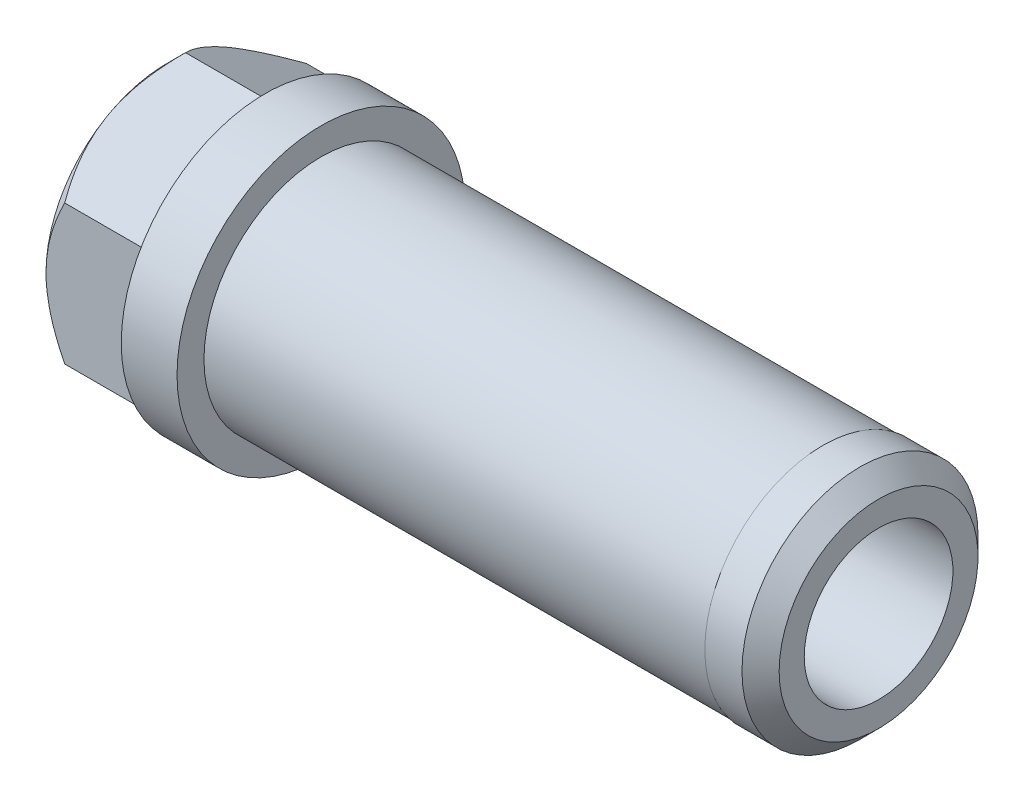
ISO-10303-21;
HEADER;
FILE_DESCRIPTION(('STEP AP214'),'2;1');
FILE_NAME('part.step','',(''),(''),'','','');
FILE_SCHEMA(('AUTOMOTIVE_DESIGN { 1 0 10303 214 1 1 1 1 }'));
ENDSEC;
DATA;
#1=APPLICATION_CONTEXT('core data for automotive mechanical design processes');
#2=APPLICATION_PROTOCOL_DEFINITION('international standard','automotive_design',2000,#1);
#3=PRODUCT_CONTEXT('',#1,'mechanical');
#4=PRODUCT('Part','Part','',(#3));
#5=PRODUCT_RELATED_PRODUCT_CATEGORY('part','',(#4));
#6=PRODUCT_DEFINITION_FORMATION('','',#4);
#7=PRODUCT_DEFINITION_CONTEXT('part definition',#1,'design');
#8=PRODUCT_DEFINITION('design','',#6,#7);
#9=PRODUCT_DEFINITION_SHAPE('','',#8);
#10=(LENGTH_UNIT() NAMED_UNIT(*) SI_UNIT(.MILLI.,.METRE.));
#11=(NAMED_UNIT(*) PLANE_ANGLE_UNIT() SI_UNIT($,.RADIAN.));
#12=(NAMED_UNIT(*) SI_UNIT($,.STERADIAN.) SOLID_ANGLE_UNIT());
#13=UNCERTAINTY_MEASURE_WITH_UNIT(LENGTH_MEASURE(1.E-05),#10,'distance_accuracy_value','');
#14=(GEOMETRIC_REPRESENTATION_CONTEXT(3) GLOBAL_UNCERTAINTY_ASSIGNED_CONTEXT((#13)) GLOBAL_UNIT_ASSIGNED_CONTEXT((#10,
#11,#12)) REPRESENTATION_CONTEXT('',''));
#15=CARTESIAN_POINT('',(0.,0.,0.));
#16=DIRECTION('',(0.,0.,1.));
#17=DIRECTION('',(1.,0.,0.));
#18=AXIS2_PLACEMENT_3D('',#15,#16,#17);
#19=CARTESIAN_POINT('',(-5.3,0.,0.));
#20=DIRECTION('',(-1.,0.,0.));
#21=DIRECTION('',(0.,0.,1.));
#22=AXIS2_PLACEMENT_3D('',#19,#20,#21);
#23=PLANE('',#22);
#24=CARTESIAN_POINT('',(-5.3,0.,0.));
#25=DIRECTION('',(-1.,0.,0.));
#26=DIRECTION('',(0.,0.,1.));
#27=AXIS2_PLACEMENT_3D('',#24,#25,#26);
#28=CIRCLE('',#27,4.5);
#29=CARTESIAN_POINT('',(-5.3,0.,4.5));
#30=VERTEX_POINT('',#29);
#31=EDGE_CURVE('E11',#30,#30,#28,.F.);
#32=ORIENTED_EDGE('',*,*,#31,.T.);
#33=EDGE_LOOP('',(#32));
#34=FACE_BOUND('',#33,.T.);
#35=CARTESIAN_POINT('',(-5.3,0.,0.));
#36=DIRECTION('',(1.,0.,0.));
#37=DIRECTION('',(0.,0.,-1.));
#38=AXIS2_PLACEMENT_3D('',#35,#36,#37);
#39=CIRCLE('',#38,6.5);
#40=CARTESIAN_POINT('',(-5.3,0.,6.5));
#41=VERTEX_POINT('',#40);
#42=CARTESIAN_POINT('',(-5.3,-5.62916512459885,3.25));
#43=VERTEX_POINT('',#42);
#44=EDGE_CURVE('E106',#41,#43,#39,.T.);
#45=ORIENTED_EDGE('',*,*,#44,.F.);
#46=CARTESIAN_POINT('',(-5.3,5.62916512459885,3.25));
#47=VERTEX_POINT('',#46);
#48=EDGE_CURVE('E49',#47,#41,#39,.T.);
#49=ORIENTED_EDGE('',*,*,#48,.F.);
#50=CARTESIAN_POINT('',(-5.3,5.62916512459885,-3.25));
#51=VERTEX_POINT('',#50);
#52=EDGE_CURVE('E137',#51,#47,#39,.T.);
#53=ORIENTED_EDGE('',*,*,#52,.F.);
#54=CARTESIAN_POINT('',(-5.3,0.,-6.5));
#55=VERTEX_POINT('',#54);
#56=EDGE_CURVE('E57',#55,#51,#39,.T.);
#57=ORIENTED_EDGE('',*,*,#56,.F.);
#58=CARTESIAN_POINT('',(-5.3,-5.62916512459886,-3.25000000000001));
#59=VERTEX_POINT('',#58);
#60=EDGE_CURVE('E135',#59,#55,#39,.T.);
#61=ORIENTED_EDGE('',*,*,#60,.F.);
#62=EDGE_CURVE('E116',#43,#59,#39,.T.);
#63=ORIENTED_EDGE('',*,*,#62,.F.);
#64=EDGE_LOOP('',(#45,#49,#53,#57,#61,#63));
#65=FACE_BOUND('',#64,.T.);
#66=ADVANCED_FACE('F34',(#34,#65),#23,.T.);
#67=CARTESIAN_POINT('',(0.,7.75,0.));
#68=DIRECTION('',(1.,0.,0.));
#69=DIRECTION('',(0.,0.,-1.));
#70=AXIS2_PLACEMENT_3D('',#67,#68,#69);
#71=PLANE('',#70);
#72=CARTESIAN_POINT('',(0.,0.,0.));
#73=DIRECTION('',(-1.,0.,0.));
#74=DIRECTION('',(0.,0.,1.));
#75=AXIS2_PLACEMENT_3D('',#72,#73,#74);
#76=CIRCLE('',#75,7.75);
#77=CARTESIAN_POINT('',(0.,0.,7.75));
#78=VERTEX_POINT('',#77);
#79=EDGE_CURVE('E267',#78,#78,#76,.T.);
#80=ORIENTED_EDGE('',*,*,#79,.T.);
#81=EDGE_LOOP('',(#80));
#82=FACE_BOUND('',#81,.T.);
#83=DIRECTION('',(0.,0.5,0.866025403784439));
#84=VECTOR('',#83,1.);
#85=CARTESIAN_POINT('',(0.,-7.50555349946514,0.));
#86=LINE('',#85,#84);
#87=CARTESIAN_POINT('',(0.,-7.50555349946514,0.));
#88=VERTEX_POINT('',#87);
#89=CARTESIAN_POINT('',(0.,-3.75277674973257,6.5));
#90=VERTEX_POINT('',#89);
#91=EDGE_CURVE('E304',#88,#90,#86,.T.);
#92=ORIENTED_EDGE('',*,*,#91,.F.);
#93=DIRECTION('',(0.,-0.5,0.866025403784438));
#94=VECTOR('',#93,1.);
#95=CARTESIAN_POINT('',(0.,-3.75277674973257,-6.50000000000001));
#96=LINE('',#95,#94);
#97=CARTESIAN_POINT('',(0.,-3.75277674973257,-6.50000000000001));
#98=VERTEX_POINT('',#97);
#99=EDGE_CURVE('E290',#98,#88,#96,.T.);
#100=ORIENTED_EDGE('',*,*,#99,.F.);
#101=DIRECTION('',(0.,-1.,0.));
#102=VECTOR('',#101,1.);
#103=CARTESIAN_POINT('',(0.,3.75277674973257,-6.5));
#104=LINE('',#103,#102);
#105=CARTESIAN_POINT('',(0.,3.75277674973257,-6.5));
#106=VERTEX_POINT('',#105);
#107=EDGE_CURVE('E293',#106,#98,#104,.T.);
#108=ORIENTED_EDGE('',*,*,#107,.F.);
#109=DIRECTION('',(0.,-0.5,-0.866025403784439));
#110=VECTOR('',#109,1.);
#111=CARTESIAN_POINT('',(0.,7.50555349946514,0.));
#112=LINE('',#111,#110);
#113=CARTESIAN_POINT('',(0.,7.50555349946514,0.));
#114=VERTEX_POINT('',#113);
#115=EDGE_CURVE('E296',#114,#106,#112,.T.);
#116=ORIENTED_EDGE('',*,*,#115,.F.);
#117=DIRECTION('',(0.,0.5,-0.866025403784439));
#118=VECTOR('',#117,1.);
#119=CARTESIAN_POINT('',(0.,3.75277674973257,6.5));
#120=LINE('',#119,#118);
#121=CARTESIAN_POINT('',(0.,3.75277674973257,6.5));
#122=VERTEX_POINT('',#121);
#123=EDGE_CURVE('E299',#122,#114,#120,.T.);
#124=ORIENTED_EDGE('',*,*,#123,.F.);
#125=DIRECTION('',(0.,1.,0.));
#126=VECTOR('',#125,1.);
#127=CARTESIAN_POINT('',(0.,-3.75277674973257,6.5));
#128=LINE('',#127,#126);
#129=EDGE_CURVE('E302',#90,#122,#128,.T.);
#130=ORIENTED_EDGE('',*,*,#129,.F.);
#131=EDGE_LOOP('',(#92,#100,#108,#116,#124,#130));
#132=FACE_BOUND('',#131,.T.);
#133=ADVANCED_FACE('F232',(#82,#132),#71,.F.);
#134=CARTESIAN_POINT('',(0.,0.,0.));
#135=DIRECTION('',(-1.,0.,0.));
#136=DIRECTION('',(0.,0.,1.));
#137=AXIS2_PLACEMENT_3D('',#134,#135,#136);
#138=CYLINDRICAL_SURFACE('',#137,4.);
#139=CARTESIAN_POINT('',(-4.80000000000001,0.,0.));
#140=DIRECTION('',(-1.,0.,0.));
#141=DIRECTION('',(0.,0.,1.));
#142=AXIS2_PLACEMENT_3D('',#139,#140,#141);
#143=CIRCLE('',#142,4.);
#144=CARTESIAN_POINT('',(-4.80000000000001,0.,4.));
#145=VERTEX_POINT('',#144);
#146=EDGE_CURVE('E42',#145,#145,#143,.T.);
#147=ORIENTED_EDGE('',*,*,#146,.T.);
#148=EDGE_LOOP('',(#147));
#149=FACE_BOUND('',#148,.T.);
#150=CARTESIAN_POINT('',(33.,0.,0.));
#151=DIRECTION('',(-1.,0.,0.));
#152=DIRECTION('',(0.,0.,1.));
#153=AXIS2_PLACEMENT_3D('',#150,#151,#152);
#154=CIRCLE('',#153,4.00000000000001);
#155=CARTESIAN_POINT('',(33.,0.,4.00000000000001));
#156=VERTEX_POINT('',#155);
#157=EDGE_CURVE('E259',#156,#156,#154,.T.);
#158=ORIENTED_EDGE('',*,*,#157,.F.);
#159=EDGE_LOOP('',(#158));
#160=FACE_BOUND('',#159,.T.);
#161=ADVANCED_FACE('F228',(#149,#160),#138,.F.);
#162=CARTESIAN_POINT('',(33.,4.00000000000001,0.));
#163=DIRECTION('',(-1.,0.,0.));
#164=DIRECTION('',(0.,0.,1.));
#165=AXIS2_PLACEMENT_3D('',#162,#163,#164);
#166=PLANE('',#165);
#167=CARTESIAN_POINT('',(33.,0.,0.));
#168=DIRECTION('',(-1.,0.,0.));
#169=DIRECTION('',(0.,0.,1.));
#170=AXIS2_PLACEMENT_3D('',#167,#168,#169);
#171=CIRCLE('',#170,5.35000000000001);
#172=CARTESIAN_POINT('',(33.,0.,5.35000000000001));
#173=VERTEX_POINT('',#172);
#174=EDGE_CURVE('E254',#173,#173,#171,.F.);
#175=ORIENTED_EDGE('',*,*,#174,.T.);
#176=EDGE_LOOP('',(#175));
#177=FACE_BOUND('',#176,.T.);
#178=ORIENTED_EDGE('',*,*,#157,.T.);
#179=EDGE_LOOP('',(#178));
#180=FACE_BOUND('',#179,.T.);
#181=ADVANCED_FACE('F224',(#177,#180),#166,.F.);
#182=CARTESIAN_POINT('',(0.,0.,0.));
#183=DIRECTION('',(-1.,0.,0.));
#184=DIRECTION('',(0.,0.,1.));
#185=AXIS2_PLACEMENT_3D('',#182,#183,#184);
#186=CYLINDRICAL_SURFACE('',#185,6.35);
#187=CARTESIAN_POINT('',(30.,0.,0.));
#188=DIRECTION('',(-1.,0.,0.));
#189=DIRECTION('',(0.,0.,1.));
#190=AXIS2_PLACEMENT_3D('',#187,#188,#189);
#191=CIRCLE('',#190,6.35);
#192=CARTESIAN_POINT('',(30.,0.,6.35));
#193=VERTEX_POINT('',#192);
#194=EDGE_CURVE('E276',#193,#193,#191,.T.);
#195=ORIENTED_EDGE('',*,*,#194,.F.);
#196=EDGE_LOOP('',(#195));
#197=FACE_BOUND('',#196,.T.);
#198=CARTESIAN_POINT('',(32.,0.,0.));
#199=DIRECTION('',(-1.,0.,0.));
#200=DIRECTION('',(0.,0.,1.));
#201=AXIS2_PLACEMENT_3D('',#198,#199,#200);
#202=CIRCLE('',#201,6.35);
#203=CARTESIAN_POINT('',(32.,0.,6.35));
#204=VERTEX_POINT('',#203);
#205=EDGE_CURVE('E257',#204,#204,#202,.T.);
#206=ORIENTED_EDGE('',*,*,#205,.T.);
#207=EDGE_LOOP('',(#206));
#208=FACE_BOUND('',#207,.T.);
#209=ADVANCED_FACE('F220',(#197,#208),#186,.T.);
#210=CARTESIAN_POINT('',(3.,6.35,0.));
#211=DIRECTION('',(-1.,0.,0.));
#212=DIRECTION('',(0.,0.,1.));
#213=AXIS2_PLACEMENT_3D('',#210,#211,#212);
#214=PLANE('',#213);
#215=CARTESIAN_POINT('',(3.,0.,0.));
#216=DIRECTION('',(-1.,0.,0.));
#217=DIRECTION('',(0.,0.,1.));
#218=AXIS2_PLACEMENT_3D('',#215,#216,#217);
#219=CIRCLE('',#218,7.75);
#220=CARTESIAN_POINT('',(3.,0.,7.75));
#221=VERTEX_POINT('',#220);
#222=EDGE_CURVE('E264',#221,#221,#219,.T.);
#223=ORIENTED_EDGE('',*,*,#222,.F.);
#224=EDGE_LOOP('',(#223));
#225=FACE_BOUND('',#224,.T.);
#226=CARTESIAN_POINT('',(3.,0.,0.));
#227=DIRECTION('',(-1.,0.,0.));
#228=DIRECTION('',(0.,0.,1.));
#229=AXIS2_PLACEMENT_3D('',#226,#227,#228);
#230=CIRCLE('',#229,6.3);
#231=CARTESIAN_POINT('',(3.,0.,6.3));
#232=VERTEX_POINT('',#231);
#233=EDGE_CURVE('E270',#232,#232,#230,.T.);
#234=ORIENTED_EDGE('',*,*,#233,.T.);
#235=EDGE_LOOP('',(#234));
#236=FACE_BOUND('',#235,.T.);
#237=ADVANCED_FACE('F216',(#225,#236),#214,.F.);
#238=CARTESIAN_POINT('',(0.,0.,0.));
#239=DIRECTION('',(-1.,0.,0.));
#240=DIRECTION('',(0.,0.,1.));
#241=AXIS2_PLACEMENT_3D('',#238,#239,#240);
#242=CYLINDRICAL_SURFACE('',#241,7.75);
#243=ORIENTED_EDGE('',*,*,#79,.F.);
#244=EDGE_LOOP('',(#243));
#245=FACE_BOUND('',#244,.T.);
#246=ORIENTED_EDGE('',*,*,#222,.T.);
#247=EDGE_LOOP('',(#246));
#248=FACE_BOUND('',#247,.T.);
#249=ADVANCED_FACE('F213',(#245,#248),#242,.T.);
#250=CARTESIAN_POINT('',(32.,0.,0.));
#251=DIRECTION('',(-1.,0.,0.));
#252=DIRECTION('',(0.,0.,1.));
#253=AXIS2_PLACEMENT_3D('',#250,#251,#252);
#254=CONICAL_SURFACE('',#253,6.35,0.785398163397452);
#255=ORIENTED_EDGE('',*,*,#174,.F.);
#256=EDGE_LOOP('',(#255));
#257=FACE_BOUND('',#256,.T.);
#258=ORIENTED_EDGE('',*,*,#205,.F.);
#259=EDGE_LOOP('',(#258));
#260=FACE_BOUND('',#259,.T.);
#261=ADVANCED_FACE('F211',(#257,#260),#254,.T.);
#262=CARTESIAN_POINT('',(3.,0.,0.));
#263=DIRECTION('',(-1.,0.,0.));
#264=DIRECTION('',(0.,0.,1.));
#265=AXIS2_PLACEMENT_3D('',#262,#263,#264);
#266=CYLINDRICAL_SURFACE('',#265,6.3);
#267=CARTESIAN_POINT('',(30.,0.,0.));
#268=DIRECTION('',(-1.,0.,0.));
#269=DIRECTION('',(0.,0.,1.));
#270=AXIS2_PLACEMENT_3D('',#267,#268,#269);
#271=CIRCLE('',#270,6.3);
#272=CARTESIAN_POINT('',(30.,0.,6.3));
#273=VERTEX_POINT('',#272);
#274=EDGE_CURVE('E273',#273,#273,#271,.T.);
#275=ORIENTED_EDGE('',*,*,#274,.T.);
#276=EDGE_LOOP('',(#275));
#277=FACE_BOUND('',#276,.T.);
#278=ORIENTED_EDGE('',*,*,#233,.F.);
#279=EDGE_LOOP('',(#278));
#280=FACE_BOUND('',#279,.T.);
#281=ADVANCED_FACE('F207',(#277,#280),#266,.T.);
#282=CARTESIAN_POINT('',(30.,6.35,0.));
#283=DIRECTION('',(1.,0.,0.));
#284=DIRECTION('',(0.,0.,-1.));
#285=AXIS2_PLACEMENT_3D('',#282,#283,#284);
#286=PLANE('',#285);
#287=ORIENTED_EDGE('',*,*,#274,.F.);
#288=EDGE_LOOP('',(#287));
#289=FACE_BOUND('',#288,.T.);
#290=ORIENTED_EDGE('',*,*,#194,.T.);
#291=EDGE_LOOP('',(#290));
#292=FACE_BOUND('',#291,.T.);
#293=ADVANCED_FACE('F204',(#289,#292),#286,.F.);
#294=CARTESIAN_POINT('',(-5.3,-7.50555349946514,0.));
#295=DIRECTION('',(0.,0.866025403784439,-0.5));
#296=DIRECTION('',(0.,0.5,0.866025403784439));
#297=AXIS2_PLACEMENT_3D('',#294,#295,#296);
#298=PLANE('',#297);
#299=DIRECTION('',(1.,0.,0.));
#300=VECTOR('',#299,1.);
#301=CARTESIAN_POINT('',(-5.3,-3.75277674973257,6.5));
#302=LINE('',#301,#300);
#303=CARTESIAN_POINT('',(-4.29444650053486,-3.75277674973257,6.5));
#304=VERTEX_POINT('',#303);
#305=EDGE_CURVE('E132',#304,#90,#302,.T.);
#306=ORIENTED_EDGE('',*,*,#305,.F.);
#307=CARTESIAN_POINT('',(-4.29433102781637,-3.75266127967873,6.5002));
#308=CARTESIAN_POINT('',(-4.35885059712556,-3.81718755645788,6.38843721019527));
#309=CARTESIAN_POINT('',(-4.42139015109449,-3.88220981195733,6.27581536004748));
#310=CARTESIAN_POINT('',(-4.54190691907866,-4.01334358271939,6.04868500649951));
#311=CARTESIAN_POINT('',(-4.59988164135834,-4.0794556693862,5.9341755133982));
#312=CARTESIAN_POINT('',(-4.76654947163492,-4.28018681300943,5.58649897398136));
#313=CARTESIAN_POINT('',(-4.86727524281449,-4.41650514865446,5.35038869064093));
#314=CARTESIAN_POINT('',(-5.03976115178075,-4.69140196688395,4.87425343462844));
#315=CARTESIAN_POINT('',(-5.11195583562559,-4.82991018943442,4.63435015590496));
#316=CARTESIAN_POINT('',(-5.1954673235371,-5.03994962333849,4.27055118479011));
#317=CARTESIAN_POINT('',(-5.21916322859299,-5.11027200006591,4.14874925538922));
#318=CARTESIAN_POINT('',(-5.25775864699646,-5.25151217356568,3.90411409881778));
#319=CARTESIAN_POINT('',(-5.27265947491082,-5.32242987974848,3.78128102855292));
#320=CARTESIAN_POINT('',(-5.2976428826817,-5.49524688598531,3.48195319333879));
#321=CARTESIAN_POINT('',(-5.30288483734236,-5.59733238973656,3.30513591412536));
#322=CARTESIAN_POINT('',(-5.2940862649858,-5.8013194001228,2.95182004805232));
#323=CARTESIAN_POINT('',(-5.28003897875086,-5.90322082972471,2.77532159461789));
#324=CARTESIAN_POINT('',(-5.23348995881094,-6.10606297517403,2.4239886927834));
#325=CARTESIAN_POINT('',(-5.20096758771143,-6.20700248809812,2.24915632790761));
#326=CARTESIAN_POINT('',(-5.11923651792241,-6.40714660889899,1.90249654184432));
#327=CARTESIAN_POINT('',(-5.0700290987382,-6.50635134919484,1.73066889130023));
#328=CARTESIAN_POINT('',(-4.96879473910504,-6.68245686028525,1.42564519859876));
#329=CARTESIAN_POINT('',(-4.91943031437605,-6.75974759545267,1.29177371833443));
#330=CARTESIAN_POINT('',(-4.8127466105512,-6.91294161848701,1.02643388702308));
#331=CARTESIAN_POINT('',(-4.75542709029214,-6.98884486421242,0.894965608967286));
#332=CARTESIAN_POINT('',(-4.63411807299276,-7.13902483818044,0.634846263775304));
#333=CARTESIAN_POINT('',(-4.57014955163368,-7.21330583760991,0.506187798726454));
#334=CARTESIAN_POINT('',(-4.43638235214271,-7.36049237141899,0.251253243979182));
#335=CARTESIAN_POINT('',(-4.36658724943982,-7.43339871615508,0.124975750702144));
#336=CARTESIAN_POINT('',(-4.29433102781636,-7.50566896951898,-0.000200000000004733));
#337=B_SPLINE_CURVE_WITH_KNOTS('',3,(#307,#308,#309,#310,#311,#312,#313,#314,#315,#316,#317,
#318,#319,#320,#321,#322,#323,#324,#325,#326,#327,#328,#329,#330,#331,#332,#333,#334,#335,#336),
.UNSPECIFIED.,.F.,.F.,(4,2,2,2,2,2,2,2,2,2,2,2,2,2,4),(0.,0.432821098198448,0.865876839223419,
1.73666364694239,2.59362329760354,3.02126269407583,3.44883815671479,4.06060100939773,
4.67257828698743,5.2852405152126,5.89785577160163,6.38444407043264,6.87104712368548,
7.35615917312025,7.84097569580795),.UNSPECIFIED.);
#338=EDGE_CURVE('E110',#304,#43,#337,.T.);
#339=ORIENTED_EDGE('',*,*,#338,.T.);
#340=CARTESIAN_POINT('',(-4.29444650053485,-7.50555349946514,0.));
#341=VERTEX_POINT('',#340);
#342=EDGE_CURVE('E120',#43,#341,#337,.T.);
#343=ORIENTED_EDGE('',*,*,#342,.T.);
#344=DIRECTION('',(1.,0.,0.));
#345=VECTOR('',#344,1.);
#346=CARTESIAN_POINT('',(-5.3,-7.50555349946514,0.));
#347=LINE('',#346,#345);
#348=EDGE_CURVE('E288',#341,#88,#347,.T.);
#349=ORIENTED_EDGE('',*,*,#348,.T.);
#350=ORIENTED_EDGE('',*,*,#91,.T.);
#351=EDGE_LOOP('',(#306,#339,#343,#349,#350));
#352=FACE_BOUND('',#351,.T.);
#353=ADVANCED_FACE('F130',(#352),#298,.F.);
#354=CARTESIAN_POINT('',(-5.3,-3.75277674973257,6.5));
#355=DIRECTION('',(0.,0.,-1.));
#356=DIRECTION('',(-1.,0.,0.));
#357=AXIS2_PLACEMENT_3D('',#354,#355,#356);
#358=PLANE('',#357);
#359=DIRECTION('',(1.,0.,0.));
#360=VECTOR('',#359,1.);
#361=CARTESIAN_POINT('',(-5.3,3.75277674973257,6.5));
#362=LINE('',#361,#360);
#363=CARTESIAN_POINT('',(-4.29444650053486,3.75277674973257,6.5));
#364=VERTEX_POINT('',#363);
#365=EDGE_CURVE('E280',#364,#122,#362,.T.);
#366=ORIENTED_EDGE('',*,*,#365,.F.);
#367=CARTESIAN_POINT('',(-0.517413931638824,-9.22207939620868,6.5));
#368=CARTESIAN_POINT('',(-0.707167696856362,-8.98986937567704,6.5));
#369=CARTESIAN_POINT('',(-0.895559671830249,-8.75652859228778,6.5));
#370=CARTESIAN_POINT('',(-1.26890088782837,-8.28701421183924,6.5));
#371=CARTESIAN_POINT('',(-1.4538492342965,-8.05083990420511,6.5));
#372=CARTESIAN_POINT('',(-1.82148698138413,-7.57260272394712,6.5));
#373=CARTESIAN_POINT('',(-2.00412950135191,-7.33050369290394,6.5));
#374=CARTESIAN_POINT('',(-2.36392166853095,-6.8422820534225,6.5));
#375=CARTESIAN_POINT('',(-2.54107183976304,-6.59615983227695,6.5));
#376=CARTESIAN_POINT('',(-2.90425007036517,-6.0763540818558,6.5));
#377=CARTESIAN_POINT('',(-3.08961430734545,-5.80220410496714,6.5));
#378=CARTESIAN_POINT('',(-3.44940867128887,-5.24663913577967,6.5));
#379=CARTESIAN_POINT('',(-3.62383529909257,-4.96522185876852,6.5));
#380=CARTESIAN_POINT('',(-3.95703864930811,-4.39492772430312,6.5));
#381=CARTESIAN_POINT('',(-4.11588374247655,-4.10609118727393,6.5));
#382=CARTESIAN_POINT('',(-4.41326718088791,-3.51824432431052,6.5));
#383=CARTESIAN_POINT('',(-4.55182280605982,-3.21924292609936,6.5));
#384=CARTESIAN_POINT('',(-4.76602965118358,-2.69564955222214,6.5));
#385=CARTESIAN_POINT('',(-4.84840518274943,-2.47382858362828,6.5));
#386=CARTESIAN_POINT('',(-4.99540761732519,-2.02424725728269,6.5));
#387=CARTESIAN_POINT('',(-5.06003208059963,-1.79648608780578,6.5));
#388=CARTESIAN_POINT('',(-5.16673539045206,-1.34092928635826,6.5));
#389=CARTESIAN_POINT('',(-5.20927796954722,-1.11324414290116,6.5));
#390=CARTESIAN_POINT('',(-5.27105469975182,-0.654712560918764,6.5));
#391=CARTESIAN_POINT('',(-5.29029424064933,-0.423866865897777,6.5));
#392=CARTESIAN_POINT('',(-5.30365216095539,0.0269240453335883,6.5));
#393=CARTESIAN_POINT('',(-5.29898577100365,0.246833328323295,6.5));
#394=CARTESIAN_POINT('',(-5.26765566422107,0.685065530097548,6.5));
#395=CARTESIAN_POINT('',(-5.24099034512715,0.903388332164373,6.5));
#396=CARTESIAN_POINT('',(-5.16674673317936,1.34067483863781,6.5));
#397=CARTESIAN_POINT('',(-5.11877897985389,1.5595712344773,6.5));
#398=CARTESIAN_POINT('',(-5.00468073399072,1.99248987285504,6.5));
#399=CARTESIAN_POINT('',(-4.93855070389491,2.20651223934399,6.5));
#400=CARTESIAN_POINT('',(-4.78887548172352,2.63583684496838,6.5));
#401=CARTESIAN_POINT('',(-4.7048501049018,2.85096958070129,6.5));
#402=CARTESIAN_POINT('',(-4.52377381007585,3.27573023239207,6.5));
#403=CARTESIAN_POINT('',(-4.42671715120136,3.4853556731919,6.5));
#404=CARTESIAN_POINT('',(-4.22187785502045,3.90006994858095,6.5));
#405=CARTESIAN_POINT('',(-4.1140626924279,4.10514258548066,6.5));
#406=CARTESIAN_POINT('',(-3.89007198525748,4.51059970145554,6.5));
#407=CARTESIAN_POINT('',(-3.77389770068543,4.71098488108213,6.5));
#408=CARTESIAN_POINT('',(-3.54072659209066,5.09786439883542,6.5));
#409=CARTESIAN_POINT('',(-3.42405464253352,5.28455557957427,6.5));
#410=CARTESIAN_POINT('',(-3.18571373207682,5.65473007752028,6.5));
#411=CARTESIAN_POINT('',(-3.06404440004035,5.83821315502568,6.5));
#412=CARTESIAN_POINT('',(-2.8175791027713,6.20092578019215,6.5));
#413=CARTESIAN_POINT('',(-2.69281574020405,6.38017756161689,6.5));
#414=CARTESIAN_POINT('',(-2.43992071799741,6.73621763060711,6.5));
#415=CARTESIAN_POINT('',(-2.31178999605901,6.91300658344261,6.5));
#416=CARTESIAN_POINT('',(-2.18228000526553,7.08876137961454,6.5));
#417=B_SPLINE_CURVE_WITH_KNOTS('',3,(#367,#368,#369,#370,#371,#372,#373,#374,#375,#376,#377,
#378,#379,#380,#381,#382,#383,#384,#385,#386,#387,#388,#389,#390,#391,#392,#393,#394,#395,#396,
#397,#398,#399,#400,#401,#402,#403,#404,#405,#406,#407,#408,#409,#410,#411,#412,#413,#414,#415,
#416),.UNSPECIFIED.,.F.,.F.,(4,2,2,2,2,2,2,2,2,2,2,2,2,2,2,2,2,2,2,2,2,2,2,2,4),(0.,
0.899655300440598,1.79954113372516,2.70927635548931,3.61892451132114,4.6115345146468,
5.60446047041306,6.59281387222118,7.58032056548333,8.28959498912522,8.99896684786634,
9.69276826574379,10.3864091827849,11.0451505681112,11.7039399362366,12.375303917667,
13.0466508066344,13.7390046386496,14.4316644908764,15.1264857855457,15.8212025653862,
16.4815589078472,17.141964381495,17.7971123100708,18.4520796947725),.UNSPECIFIED.);
#418=EDGE_CURVE('E187',#364,#41,#417,.F.);
#419=ORIENTED_EDGE('',*,*,#418,.T.);
#420=EDGE_CURVE('E112',#41,#304,#417,.F.);
#421=ORIENTED_EDGE('',*,*,#420,.T.);
#422=ORIENTED_EDGE('',*,*,#305,.T.);
#423=ORIENTED_EDGE('',*,*,#129,.T.);
#424=EDGE_LOOP('',(#366,#419,#421,#422,#423));
#425=FACE_BOUND('',#424,.T.);
#426=ADVANCED_FACE('F195',(#425),#358,.F.);
#427=CARTESIAN_POINT('',(-5.3,3.75277674973257,6.5));
#428=DIRECTION('',(0.,-0.866025403784439,-0.5));
#429=DIRECTION('',(0.,0.5,-0.866025403784439));
#430=AXIS2_PLACEMENT_3D('',#427,#428,#429);
#431=PLANE('',#430);
#432=DIRECTION('',(1.,0.,0.));
#433=VECTOR('',#432,1.);
#434=CARTESIAN_POINT('',(-5.3,7.50555349946514,0.));
#435=LINE('',#434,#433);
#436=CARTESIAN_POINT('',(-4.29444650053486,7.50555349946514,0.));
#437=VERTEX_POINT('',#436);
#438=EDGE_CURVE('E282',#437,#114,#435,.T.);
#439=ORIENTED_EDGE('',*,*,#438,.F.);
#440=CARTESIAN_POINT('',(-4.29433102781637,7.50566896951897,-0.000199999999998316));
#441=CARTESIAN_POINT('',(-4.35885059712556,7.44114269273983,0.111562789804734));
#442=CARTESIAN_POINT('',(-4.42139015109449,7.37612043724037,0.224184639952523));
#443=CARTESIAN_POINT('',(-4.54190691907866,7.24498666647831,0.451314993500496));
#444=CARTESIAN_POINT('',(-4.59988164135834,7.17887457981151,0.565824486601798));
#445=CARTESIAN_POINT('',(-4.76654947163492,6.97814343618828,0.913501026018642));
#446=CARTESIAN_POINT('',(-4.86727524281449,6.84182510054324,1.14961130935907));
#447=CARTESIAN_POINT('',(-5.03976115178075,6.56692828231375,1.62574656537157));
#448=CARTESIAN_POINT('',(-5.11195583562559,6.42842005976328,1.86564984409504));
#449=CARTESIAN_POINT('',(-5.19546732353709,6.21838062585922,2.22944881520989));
#450=CARTESIAN_POINT('',(-5.21916322859299,6.14805824913179,2.35125074461079));
#451=CARTESIAN_POINT('',(-5.25775864699646,6.00681807563203,2.59588590118222));
#452=CARTESIAN_POINT('',(-5.27265947491082,5.93590036944922,2.71871897144709));
#453=CARTESIAN_POINT('',(-5.2976428826817,5.76308336321239,3.01804680666122));
#454=CARTESIAN_POINT('',(-5.30288483734236,5.66099785946114,3.19486408587465));
#455=CARTESIAN_POINT('',(-5.2940862649858,5.45701084907491,3.54817995194769));
#456=CARTESIAN_POINT('',(-5.28003897875086,5.35510941947299,3.72467840538211));
#457=CARTESIAN_POINT('',(-5.23348995881094,5.15226727402367,4.0760113072166));
#458=CARTESIAN_POINT('',(-5.20096758771143,5.05132776109958,4.25084367209239));
#459=CARTESIAN_POINT('',(-5.11923651792241,4.85118364029872,4.59750345815569));
#460=CARTESIAN_POINT('',(-5.07002909873819,4.75197890000287,4.76933110869977));
#461=CARTESIAN_POINT('',(-4.96879473910504,4.57587338891246,5.07435480140125));
#462=CARTESIAN_POINT('',(-4.91943031437605,4.49858265374504,5.20822628166557));
#463=CARTESIAN_POINT('',(-4.8127466105512,4.3453886307107,5.47356611297692));
#464=CARTESIAN_POINT('',(-4.75542709029214,4.26948538498529,5.60503439103271));
#465=CARTESIAN_POINT('',(-4.63411807299276,4.11930541101727,5.86515373622469));
#466=CARTESIAN_POINT('',(-4.57014955163368,4.04502441158779,5.99381220127354));
#467=CARTESIAN_POINT('',(-4.43638235214271,3.89783787777872,6.24874675602081));
#468=CARTESIAN_POINT('',(-4.36658724943983,3.82493153304263,6.37502424929785));
#469=CARTESIAN_POINT('',(-4.29433102781637,3.75266127967873,6.5002));
#470=B_SPLINE_CURVE_WITH_KNOTS('',3,(#440,#441,#442,#443,#444,#445,#446,#447,#448,#449,#450,
#451,#452,#453,#454,#455,#456,#457,#458,#459,#460,#461,#462,#463,#464,#465,#466,#467,#468,#469),
.UNSPECIFIED.,.F.,.F.,(4,2,2,2,2,2,2,2,2,2,2,2,2,2,4),(0.,0.432821098198448,0.865876839223419,
1.73666364694239,2.59362329760355,3.02126269407583,3.4488381567148,4.06060100939773,
4.67257828698743,5.2852405152126,5.89785577160164,6.38444407043264,6.87104712368548,
7.35615917312024,7.84097569580794),.UNSPECIFIED.);
#471=EDGE_CURVE('E305',#437,#47,#470,.T.);
#472=ORIENTED_EDGE('',*,*,#471,.T.);
#473=EDGE_CURVE('E188',#47,#364,#470,.T.);
#474=ORIENTED_EDGE('',*,*,#473,.T.);
#475=ORIENTED_EDGE('',*,*,#365,.T.);
#476=ORIENTED_EDGE('',*,*,#123,.T.);
#477=EDGE_LOOP('',(#439,#472,#474,#475,#476));
#478=FACE_BOUND('',#477,.T.);
#479=ADVANCED_FACE('F198',(#478),#431,.F.);
#480=CARTESIAN_POINT('',(-5.3,7.50555349946514,0.));
#481=DIRECTION('',(0.,-0.866025403784439,0.5));
#482=DIRECTION('',(0.,-0.5,-0.866025403784439));
#483=AXIS2_PLACEMENT_3D('',#480,#481,#482);
#484=PLANE('',#483);
#485=DIRECTION('',(1.,0.,0.));
#486=VECTOR('',#485,1.);
#487=CARTESIAN_POINT('',(-5.3,3.75277674973257,-6.5));
#488=LINE('',#487,#486);
#489=CARTESIAN_POINT('',(-4.29444650053485,3.75277674973257,-6.5));
#490=VERTEX_POINT('',#489);
#491=EDGE_CURVE('E284',#490,#106,#488,.T.);
#492=ORIENTED_EDGE('',*,*,#491,.F.);
#493=CARTESIAN_POINT('',(-4.29433102781636,3.75266127967873,-6.5002));
#494=CARTESIAN_POINT('',(-4.35885059712556,3.81718755645788,-6.38843721019527));
#495=CARTESIAN_POINT('',(-4.42139015109449,3.88220981195734,-6.27581536004748));
#496=CARTESIAN_POINT('',(-4.54190691907866,4.01334358271939,-6.04868500649951));
#497=CARTESIAN_POINT('',(-4.59988164135834,4.0794556693862,-5.93417551339821));
#498=CARTESIAN_POINT('',(-4.76654947163492,4.28018681300943,-5.58649897398136));
#499=CARTESIAN_POINT('',(-4.86727524281449,4.41650514865446,-5.35038869064093));
#500=CARTESIAN_POINT('',(-5.03976115178075,4.69140196688395,-4.87425343462844));
#501=CARTESIAN_POINT('',(-5.11195583562559,4.82991018943443,-4.63435015590496));
#502=CARTESIAN_POINT('',(-5.19546732353709,5.03994962333849,-4.27055118479011));
#503=CARTESIAN_POINT('',(-5.21916322859299,5.11027200006591,-4.14874925538922));
#504=CARTESIAN_POINT('',(-5.25775864699646,5.25151217356568,-3.90411409881778));
#505=CARTESIAN_POINT('',(-5.27265947491082,5.32242987974849,-3.78128102855292));
#506=CARTESIAN_POINT('',(-5.2976428826817,5.49524688598531,-3.48195319333878));
#507=CARTESIAN_POINT('',(-5.30288483734236,5.59733238973656,-3.30513591412535));
#508=CARTESIAN_POINT('',(-5.2940862649858,5.8013194001228,-2.95182004805232));
#509=CARTESIAN_POINT('',(-5.28003897875086,5.90322082972472,-2.77532159461789));
#510=CARTESIAN_POINT('',(-5.23348995881094,6.10606297517403,-2.4239886927834));
#511=CARTESIAN_POINT('',(-5.20096758771143,6.20700248809813,-2.24915632790761));
#512=CARTESIAN_POINT('',(-5.11923651792241,6.40714660889899,-1.90249654184431));
#513=CARTESIAN_POINT('',(-5.07002909873819,6.50635134919484,-1.73066889130023));
#514=CARTESIAN_POINT('',(-4.96879473910504,6.68245686028525,-1.42564519859876));
#515=CARTESIAN_POINT('',(-4.91943031437605,6.75974759545267,-1.29177371833443));
#516=CARTESIAN_POINT('',(-4.8127466105512,6.91294161848701,-1.02643388702308));
#517=CARTESIAN_POINT('',(-4.75542709029214,6.98884486421242,-0.894965608967286));
#518=CARTESIAN_POINT('',(-4.63411807299276,7.13902483818044,-0.634846263775305));
#519=CARTESIAN_POINT('',(-4.57014955163368,7.21330583760991,-0.506187798726455));
#520=CARTESIAN_POINT('',(-4.43638235214271,7.36049237141899,-0.251253243979185));
#521=CARTESIAN_POINT('',(-4.36658724943982,7.43339871615508,-0.124975750702147));
#522=CARTESIAN_POINT('',(-4.29433102781636,7.50566896951898,0.000200000000001942));
#523=B_SPLINE_CURVE_WITH_KNOTS('',3,(#493,#494,#495,#496,#497,#498,#499,#500,#501,#502,#503,
#504,#505,#506,#507,#508,#509,#510,#511,#512,#513,#514,#515,#516,#517,#518,#519,#520,#521,#522),
.UNSPECIFIED.,.F.,.F.,(4,2,2,2,2,2,2,2,2,2,2,2,2,2,4),(0.,0.432821098198449,0.86587683922342,
1.73666364694239,2.59362329760355,3.02126269407583,3.4488381567148,4.06060100939774,
4.67257828698744,5.2852405152126,5.89785577160164,6.38444407043265,6.87104712368549,
7.35615917312025,7.84097569580795),.UNSPECIFIED.);
#524=EDGE_CURVE('E176',#490,#51,#523,.T.);
#525=ORIENTED_EDGE('',*,*,#524,.T.);
#526=EDGE_CURVE('E310',#51,#437,#523,.T.);
#527=ORIENTED_EDGE('',*,*,#526,.T.);
#528=ORIENTED_EDGE('',*,*,#438,.T.);
#529=ORIENTED_EDGE('',*,*,#115,.T.);
#530=EDGE_LOOP('',(#492,#525,#527,#528,#529));
#531=FACE_BOUND('',#530,.T.);
#532=ADVANCED_FACE('F320',(#531),#484,.F.);
#533=CARTESIAN_POINT('',(-5.3,3.75277674973257,-6.5));
#534=DIRECTION('',(0.,0.,1.));
#535=DIRECTION('',(0.,-1.,0.));
#536=AXIS2_PLACEMENT_3D('',#533,#534,#535);
#537=PLANE('',#536);
#538=DIRECTION('',(1.,0.,0.));
#539=VECTOR('',#538,1.);
#540=CARTESIAN_POINT('',(-5.3,-3.75277674973257,-6.50000000000001));
#541=LINE('',#540,#539);
#542=CARTESIAN_POINT('',(-4.29444650053485,-3.75277674973257,-6.50000000000001));
#543=VERTEX_POINT('',#542);
#544=EDGE_CURVE('E286',#543,#98,#541,.T.);
#545=ORIENTED_EDGE('',*,*,#544,.F.);
#546=CARTESIAN_POINT('',(-0.517413931449834,-9.22207939643989,-6.50000000000001));
#547=CARTESIAN_POINT('',(-0.707167696674668,-8.98986937590126,-6.50000000000001));
#548=CARTESIAN_POINT('',(-0.895559671655848,-8.75652859250498,-6.50000000000001));
#549=CARTESIAN_POINT('',(-1.26890088766854,-8.28701421204239,-6.50000000000001));
#550=CARTESIAN_POINT('',(-1.45384923414394,-8.05083990440121,-6.50000000000001));
#551=CARTESIAN_POINT('',(-1.82148698124625,-7.57260272412886,-6.50000000000001));
#552=CARTESIAN_POINT('',(-2.00412950122142,-7.33050369307838,-6.50000000000001));
#553=CARTESIAN_POINT('',(-2.36392166841518,-6.84228205358222,-6.50000000000001));
#554=CARTESIAN_POINT('',(-2.54107183965458,-6.59615983242927,-6.50000000000001));
#555=CARTESIAN_POINT('',(-2.90425007027247,-6.07635408199163,-6.50000000000001));
#556=CARTESIAN_POINT('',(-3.08961430726116,-5.80220410509386,-6.50000000000001));
#557=CARTESIAN_POINT('',(-3.44940867122105,-5.24663913588782,-6.50000000000001));
#558=CARTESIAN_POINT('',(-3.6238352990328,-4.96522185886723,-6.50000000000001));
#559=CARTESIAN_POINT('',(-3.95703864926377,-4.39492772438258,-6.50000000000001));
#560=CARTESIAN_POINT('',(-4.11588374243958,-4.10609118734358,-6.50000000000001));
#561=CARTESIAN_POINT('',(-4.41326718086464,-3.51824432435993,-6.50000000000001));
#562=CARTESIAN_POINT('',(-4.55182280604287,-3.21924292613832,-6.50000000000001));
#563=CARTESIAN_POINT('',(-4.76602965117127,-2.69564955225396,-6.50000000000001));
#564=CARTESIAN_POINT('',(-4.84840518273662,-2.4738285836639,-6.50000000000001));
#565=CARTESIAN_POINT('',(-4.99540761731215,-2.02424725732608,-6.50000000000001));
#566=CARTESIAN_POINT('',(-5.06003208058686,-1.79648608785313,-6.50000000000001));
#567=CARTESIAN_POINT('',(-5.16673539044077,-1.3409292864134,-6.50000000000001));
#568=CARTESIAN_POINT('',(-5.20927796953712,-1.11324414296013,-6.50000000000001));
#569=CARTESIAN_POINT('',(-5.27105469974501,-0.654712560985293,-6.50000000000001));
#570=CARTESIAN_POINT('',(-5.29029424064462,-0.423866865968037,-6.50000000000001));
#571=CARTESIAN_POINT('',(-5.30365216095562,0.0269240452572174,-6.50000000000001));
#572=CARTESIAN_POINT('',(-5.29898577100657,0.246833328244534,-6.5));
#573=CARTESIAN_POINT('',(-5.26765566422973,0.685065530014307,-6.5));
#574=CARTESIAN_POINT('',(-5.24099034513886,0.903388332079041,-6.5));
#575=CARTESIAN_POINT('',(-5.16674673319738,1.34067483854835,-6.5));
#576=CARTESIAN_POINT('',(-5.1187789798752,1.55957123438581,-6.5));
#577=CARTESIAN_POINT('',(-5.00468073401863,1.99248987275973,-6.5));
#578=CARTESIAN_POINT('',(-4.93855070392611,2.20651223924688,-6.5));
#579=CARTESIAN_POINT('',(-4.78887548176393,2.63583684486027,-6.5));
#580=CARTESIAN_POINT('',(-4.70485010494868,2.85096958058416,-6.5));
#581=CARTESIAN_POINT('',(-4.52377381013632,3.27573023225736,-6.5));
#582=CARTESIAN_POINT('',(-4.42671715126894,3.48535567304863,-6.5));
#583=CARTESIAN_POINT('',(-4.2218778551027,3.90006994842087,-6.5));
#584=CARTESIAN_POINT('',(-4.11406269251769,4.10514258531234,-6.5));
#585=CARTESIAN_POINT('',(-3.89007198536262,4.51059970127099,-6.5));
#586=CARTESIAN_POINT('',(-3.77389770079835,4.7109848808896,-6.5));
#587=CARTESIAN_POINT('',(-3.54072659221836,5.09786439862844,-6.5));
#588=CARTESIAN_POINT('',(-3.42405464266816,5.2845555793608,-6.5));
#589=CARTESIAN_POINT('',(-3.18571373222538,5.65473007729391,-6.5));
#590=CARTESIAN_POINT('',(-3.06404440019588,5.8382131547929,-6.5));
#591=CARTESIAN_POINT('',(-2.8175791029407,6.20092577994672,-6.5));
#592=CARTESIAN_POINT('',(-2.69281574038034,6.3801775613652,-6.5));
#593=CARTESIAN_POINT('',(-2.43992071818748,6.73621763034297,-6.5));
#594=CARTESIAN_POINT('',(-2.31178999625596,6.91300658317227,-6.5));
#595=CARTESIAN_POINT('',(-2.18228000546936,7.08876137933799,-6.5));
#596=B_SPLINE_CURVE_WITH_KNOTS('',3,(#546,#547,#548,#549,#550,#551,#552,#553,#554,#555,#556,
#557,#558,#559,#560,#561,#562,#563,#564,#565,#566,#567,#568,#569,#570,#571,#572,#573,#574,#575,
#576,#577,#578,#579,#580,#581,#582,#583,#584,#585,#586,#587,#588,#589,#590,#591,#592,#593,#594,
#595),.UNSPECIFIED.,.F.,.F.,(4,2,2,2,2,2,2,2,2,2,2,2,2,2,2,2,2,2,2,2,2,2,2,2,4),(0.,
0.899655300470697,1.79954113378537,2.70927635558038,3.61892451144307,4.6115345148055,
5.60446047060857,6.59281387245308,7.58032056575153,8.28959498938224,8.99896684811221,
9.6927682659791,10.3864091830096,11.0451505683286,11.7039399364467,12.375303917869,
13.0466508068284,13.7390046388114,14.4316644910059,15.1264857856428,15.8212025654509,
16.4815589078843,17.1419643815045,17.7971123100531,18.4520796947277),.UNSPECIFIED.);
#597=EDGE_CURVE('E127',#543,#55,#596,.T.);
#598=ORIENTED_EDGE('',*,*,#597,.T.);
#599=EDGE_CURVE('E133',#55,#490,#596,.T.);
#600=ORIENTED_EDGE('',*,*,#599,.T.);
#601=ORIENTED_EDGE('',*,*,#491,.T.);
#602=ORIENTED_EDGE('',*,*,#107,.T.);
#603=EDGE_LOOP('',(#545,#598,#600,#601,#602));
#604=FACE_BOUND('',#603,.T.);
#605=ADVANCED_FACE('F151',(#604),#537,.F.);
#606=CARTESIAN_POINT('',(-5.3,-3.75277674973257,-6.50000000000001));
#607=DIRECTION('',(0.,0.866025403784438,0.5));
#608=DIRECTION('',(0.,-0.5,0.866025403784438));
#609=AXIS2_PLACEMENT_3D('',#606,#607,#608);
#610=PLANE('',#609);
#611=ORIENTED_EDGE('',*,*,#348,.F.);
#612=CARTESIAN_POINT('',(-4.29433102781636,-7.50566896951898,0.000199999999995719));
#613=CARTESIAN_POINT('',(-4.35885059712556,-7.44114269273983,-0.111562789804736));
#614=CARTESIAN_POINT('',(-4.42139015109449,-7.37612043724037,-0.224184639952525));
#615=CARTESIAN_POINT('',(-4.54190691907866,-7.24498666647832,-0.451314993500498));
#616=CARTESIAN_POINT('',(-4.59988164135834,-7.17887457981151,-0.5658244866018));
#617=CARTESIAN_POINT('',(-4.76654947163492,-6.97814343618828,-0.913501026018645));
#618=CARTESIAN_POINT('',(-4.86727524281448,-6.84182510054324,-1.14961130935907));
#619=CARTESIAN_POINT('',(-5.03976115178075,-6.56692828231376,-1.62574656537157));
#620=CARTESIAN_POINT('',(-5.11195583562559,-6.42842005976328,-1.86564984409505));
#621=CARTESIAN_POINT('',(-5.19546732353709,-6.21838062585922,-2.22944881520989));
#622=CARTESIAN_POINT('',(-5.21916322859299,-6.14805824913179,-2.35125074461079));
#623=CARTESIAN_POINT('',(-5.25775864699645,-6.00681807563203,-2.59588590118222));
#624=CARTESIAN_POINT('',(-5.27265947491082,-5.93590036944922,-2.71871897144709));
#625=CARTESIAN_POINT('',(-5.2976428826817,-5.7630833632124,-3.01804680666122));
#626=CARTESIAN_POINT('',(-5.30288483734236,-5.66099785946114,-3.19486408587465));
#627=CARTESIAN_POINT('',(-5.2940862649858,-5.45701084907491,-3.54817995194769));
#628=CARTESIAN_POINT('',(-5.28003897875086,-5.35510941947299,-3.72467840538211));
#629=CARTESIAN_POINT('',(-5.23348995881094,-5.15226727402367,-4.07601130721661));
#630=CARTESIAN_POINT('',(-5.20096758771143,-5.05132776109958,-4.25084367209239));
#631=CARTESIAN_POINT('',(-5.11923651792241,-4.85118364029872,-4.59750345815569));
#632=CARTESIAN_POINT('',(-5.07002909873819,-4.75197890000287,-4.76933110869978));
#633=CARTESIAN_POINT('',(-4.96879473910503,-4.57587338891246,-5.07435480140125));
#634=CARTESIAN_POINT('',(-4.91943031437604,-4.49858265374503,-5.20822628166558));
#635=CARTESIAN_POINT('',(-4.81274661055119,-4.3453886307107,-5.47356611297692));
#636=CARTESIAN_POINT('',(-4.75542709029214,-4.26948538498529,-5.60503439103272));
#637=CARTESIAN_POINT('',(-4.63411807299276,-4.11930541101727,-5.8651537362247));
#638=CARTESIAN_POINT('',(-4.57014955163368,-4.04502441158779,-5.99381220127355));
#639=CARTESIAN_POINT('',(-4.4363823521427,-3.89783787777872,-6.24874675602082));
#640=CARTESIAN_POINT('',(-4.36658724943982,-3.82493153304263,-6.37502424929786));
#641=CARTESIAN_POINT('',(-4.29433102781636,-3.75266127967873,-6.5002));
#642=B_SPLINE_CURVE_WITH_KNOTS('',3,(#612,#613,#614,#615,#616,#617,#618,#619,#620,#621,#622,
#623,#624,#625,#626,#627,#628,#629,#630,#631,#632,#633,#634,#635,#636,#637,#638,#639,#640,#641),
.UNSPECIFIED.,.F.,.F.,(4,2,2,2,2,2,2,2,2,2,2,2,2,2,4),(0.,0.432821098198448,0.86587683922342,
1.73666364694239,2.59362329760355,3.02126269407583,3.4488381567148,4.06060100939773,
4.67257828698743,5.2852405152126,5.89785577160164,6.38444407043265,6.87104712368548,
7.35615917312025,7.84097569580795),.UNSPECIFIED.);
#643=EDGE_CURVE('E124',#341,#59,#642,.T.);
#644=ORIENTED_EDGE('',*,*,#643,.T.);
#645=EDGE_CURVE('E166',#59,#543,#642,.T.);
#646=ORIENTED_EDGE('',*,*,#645,.T.);
#647=ORIENTED_EDGE('',*,*,#544,.T.);
#648=ORIENTED_EDGE('',*,*,#99,.T.);
#649=EDGE_LOOP('',(#611,#644,#646,#647,#648));
#650=FACE_BOUND('',#649,.T.);
#651=ADVANCED_FACE('F326',(#650),#610,.F.);
#652=CARTESIAN_POINT('',(-5.3,0.,0.));
#653=DIRECTION('',(1.,0.,0.));
#654=DIRECTION('',(0.,0.,-1.));
#655=AXIS2_PLACEMENT_3D('',#652,#653,#654);
#656=CONICAL_SURFACE('',#655,6.5,0.785398163397443);
#657=ORIENTED_EDGE('',*,*,#645,.F.);
#658=ORIENTED_EDGE('',*,*,#60,.T.);
#659=ORIENTED_EDGE('',*,*,#597,.F.);
#660=EDGE_LOOP('',(#657,#658,#659));
#661=FACE_BOUND('',#660,.T.);
#662=ADVANCED_FACE('F162',(#661),#656,.T.);
#663=ORIENTED_EDGE('',*,*,#62,.T.);
#664=ORIENTED_EDGE('',*,*,#643,.F.);
#665=ORIENTED_EDGE('',*,*,#342,.F.);
#666=EDGE_LOOP('',(#663,#664,#665));
#667=FACE_BOUND('',#666,.T.);
#668=ADVANCED_FACE('F121',(#667),#656,.T.);
#669=ORIENTED_EDGE('',*,*,#599,.F.);
#670=ORIENTED_EDGE('',*,*,#56,.T.);
#671=ORIENTED_EDGE('',*,*,#524,.F.);
#672=EDGE_LOOP('',(#669,#670,#671));
#673=FACE_BOUND('',#672,.T.);
#674=ADVANCED_FACE('F160',(#673),#656,.T.);
#675=ORIENTED_EDGE('',*,*,#526,.F.);
#676=ORIENTED_EDGE('',*,*,#52,.T.);
#677=ORIENTED_EDGE('',*,*,#471,.F.);
#678=EDGE_LOOP('',(#675,#676,#677));
#679=FACE_BOUND('',#678,.T.);
#680=ADVANCED_FACE('F155',(#679),#656,.T.);
#681=ORIENTED_EDGE('',*,*,#48,.T.);
#682=ORIENTED_EDGE('',*,*,#418,.F.);
#683=ORIENTED_EDGE('',*,*,#473,.F.);
#684=EDGE_LOOP('',(#681,#682,#683));
#685=FACE_BOUND('',#684,.T.);
#686=ADVANCED_FACE('F159',(#685),#656,.T.);
#687=ORIENTED_EDGE('',*,*,#44,.T.);
#688=ORIENTED_EDGE('',*,*,#338,.F.);
#689=ORIENTED_EDGE('',*,*,#420,.F.);
#690=EDGE_LOOP('',(#687,#688,#689));
#691=FACE_BOUND('',#690,.T.);
#692=ADVANCED_FACE('F108',(#691),#656,.T.);
#693=CARTESIAN_POINT('',(-4.80000000000001,0.,0.));
#694=DIRECTION('',(-1.,0.,0.));
#695=DIRECTION('',(0.,0.,1.));
#696=AXIS2_PLACEMENT_3D('',#693,#694,#695);
#697=CONICAL_SURFACE('',#696,4.,0.785398163397448);
#698=ORIENTED_EDGE('',*,*,#31,.F.);
#699=EDGE_LOOP('',(#698));
#700=FACE_BOUND('',#699,.T.);
#701=ORIENTED_EDGE('',*,*,#146,.F.);
#702=EDGE_LOOP('',(#701));
#703=FACE_BOUND('',#702,.T.);
#704=ADVANCED_FACE('F36',(#700,#703),#697,.F.);
#705=CLOSED_SHELL('',(#66,#133,#161,#181,#209,#237,#249,#261,#281,#293,#353,#426,#479,#532,#605,
#651,#662,#668,#674,#680,#686,#692,#704));
#706=MANIFOLD_SOLID_BREP('B2',#705);
#707=ADVANCED_BREP_SHAPE_REPRESENTATION('',(#18,#706),#14);
#708=SHAPE_DEFINITION_REPRESENTATION(#9,#707);
ENDSEC;
END-ISO-10303-21;
